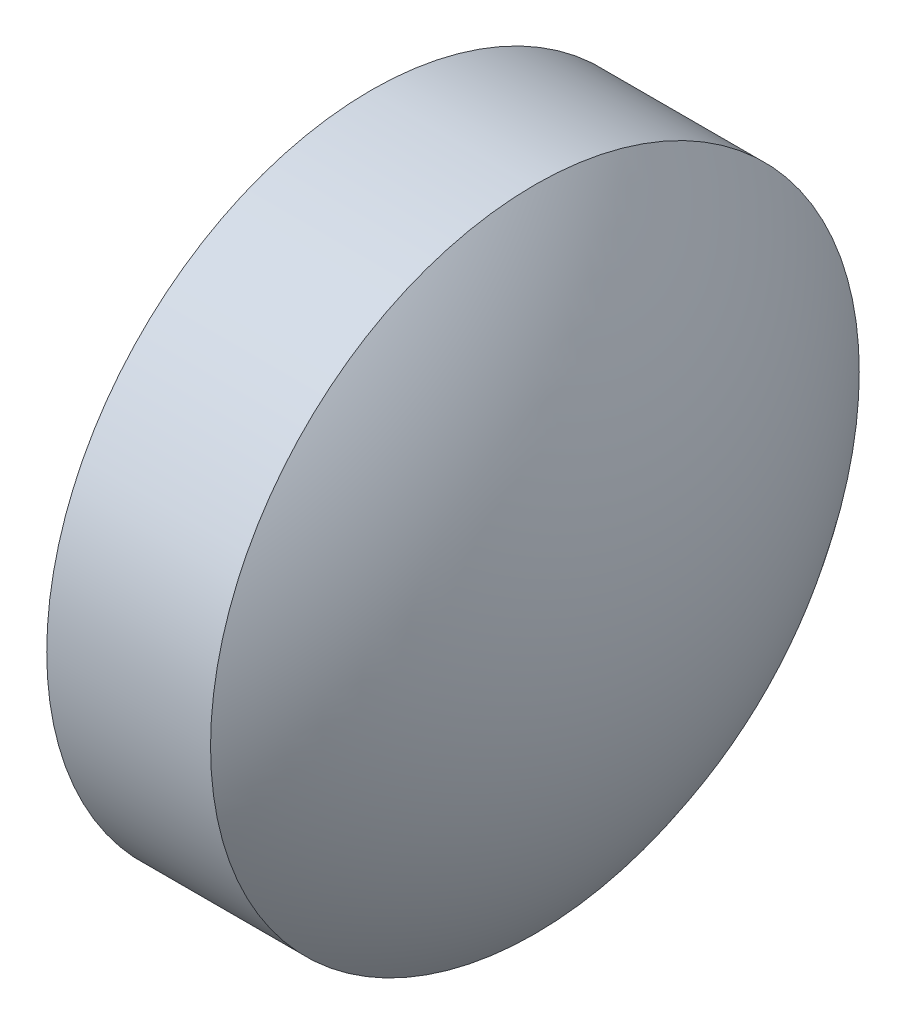
ISO-10303-21;
HEADER;
FILE_DESCRIPTION(('STEP AP214'),'2;1');
FILE_NAME('part.step','',(''),(''),'','','');
FILE_SCHEMA(('AUTOMOTIVE_DESIGN { 1 0 10303 214 1 1 1 1 }'));
ENDSEC;
DATA;
#1=APPLICATION_CONTEXT('core data for automotive mechanical design processes');
#2=APPLICATION_PROTOCOL_DEFINITION('international standard','automotive_design',2000,#1);
#3=PRODUCT_CONTEXT('',#1,'mechanical');
#4=PRODUCT('Part','Part','',(#3));
#5=PRODUCT_RELATED_PRODUCT_CATEGORY('part','',(#4));
#6=PRODUCT_DEFINITION_FORMATION('','',#4);
#7=PRODUCT_DEFINITION_CONTEXT('part definition',#1,'design');
#8=PRODUCT_DEFINITION('design','',#6,#7);
#9=PRODUCT_DEFINITION_SHAPE('','',#8);
#10=(LENGTH_UNIT() NAMED_UNIT(*) SI_UNIT(.MILLI.,.METRE.));
#11=(NAMED_UNIT(*) PLANE_ANGLE_UNIT() SI_UNIT($,.RADIAN.));
#12=(NAMED_UNIT(*) SI_UNIT($,.STERADIAN.) SOLID_ANGLE_UNIT());
#13=UNCERTAINTY_MEASURE_WITH_UNIT(LENGTH_MEASURE(1.E-05),#10,'distance_accuracy_value','');
#14=(GEOMETRIC_REPRESENTATION_CONTEXT(3) GLOBAL_UNCERTAINTY_ASSIGNED_CONTEXT((#13)) GLOBAL_UNIT_ASSIGNED_CONTEXT((#10,
#11,#12)) REPRESENTATION_CONTEXT('',''));
#15=CARTESIAN_POINT('',(0.,0.,0.));
#16=DIRECTION('',(0.,0.,1.));
#17=DIRECTION('',(1.,0.,0.));
#18=AXIS2_PLACEMENT_3D('',#15,#16,#17);
#19=CARTESIAN_POINT('',(386.139176500426,21.6853942356821,0.));
#20=DIRECTION('',(-1.,0.,0.));
#21=DIRECTION('',(0.,-1.,0.));
#22=AXIS2_PLACEMENT_3D('',#19,#20,#21);
#23=SPHERICAL_SURFACE('',#22,3.24355072463766);
#24=CARTESIAN_POINT('',(388.692727225064,21.6853942356821,0.));
#25=DIRECTION('',(-1.,0.,0.));
#26=DIRECTION('',(0.,0.,1.));
#27=AXIS2_PLACEMENT_3D('',#24,#25,#26);
#28=CIRCLE('',#27,2.);
#29=CARTESIAN_POINT('',(388.692727225064,21.6853942356821,2.));
#30=VERTEX_POINT('',#29);
#31=EDGE_CURVE('E10',#30,#30,#28,.T.);
#32=ORIENTED_EDGE('',*,*,#31,.F.);
#33=EDGE_LOOP('',(#32));
#34=FACE_BOUND('',#33,.T.);
#35=ADVANCED_FACE('F35',(#34),#23,.T.);
#36=CARTESIAN_POINT('',(387.335476666068,21.6853942356821,0.));
#37=DIRECTION('',(-1.,0.,0.));
#38=DIRECTION('',(0.,0.,1.));
#39=AXIS2_PLACEMENT_3D('',#36,#37,#38);
#40=CYLINDRICAL_SURFACE('',#39,2.);
#41=CARTESIAN_POINT('',(387.682727225064,21.6853942356821,0.));
#42=DIRECTION('',(-1.,0.,0.));
#43=DIRECTION('',(0.,0.,1.));
#44=AXIS2_PLACEMENT_3D('',#41,#42,#43);
#45=CIRCLE('',#44,2.);
#46=CARTESIAN_POINT('',(387.682727225064,21.6853942356821,2.));
#47=VERTEX_POINT('',#46);
#48=EDGE_CURVE('E41',#47,#47,#45,.T.);
#49=ORIENTED_EDGE('',*,*,#48,.F.);
#50=EDGE_LOOP('',(#49));
#51=FACE_BOUND('',#50,.T.);
#52=ORIENTED_EDGE('',*,*,#31,.T.);
#53=EDGE_LOOP('',(#52));
#54=FACE_BOUND('',#53,.T.);
#55=ADVANCED_FACE('F49',(#51,#54),#40,.T.);
#56=CARTESIAN_POINT('',(387.682727225064,21.6853942356821,0.));
#57=DIRECTION('',(1.,0.,0.));
#58=DIRECTION('',(0.,0.,-1.));
#59=AXIS2_PLACEMENT_3D('',#56,#57,#58);
#60=PLANE('',#59);
#61=ORIENTED_EDGE('',*,*,#48,.T.);
#62=EDGE_LOOP('',(#61));
#63=FACE_BOUND('',#62,.T.);
#64=ADVANCED_FACE('F47',(#63),#60,.F.);
#65=CLOSED_SHELL('',(#35,#55,#64));
#66=MANIFOLD_SOLID_BREP('B2',#65);
#67=ADVANCED_BREP_SHAPE_REPRESENTATION('',(#18,#66),#14);
#68=SHAPE_DEFINITION_REPRESENTATION(#9,#67);
ENDSEC;
END-ISO-10303-21;
